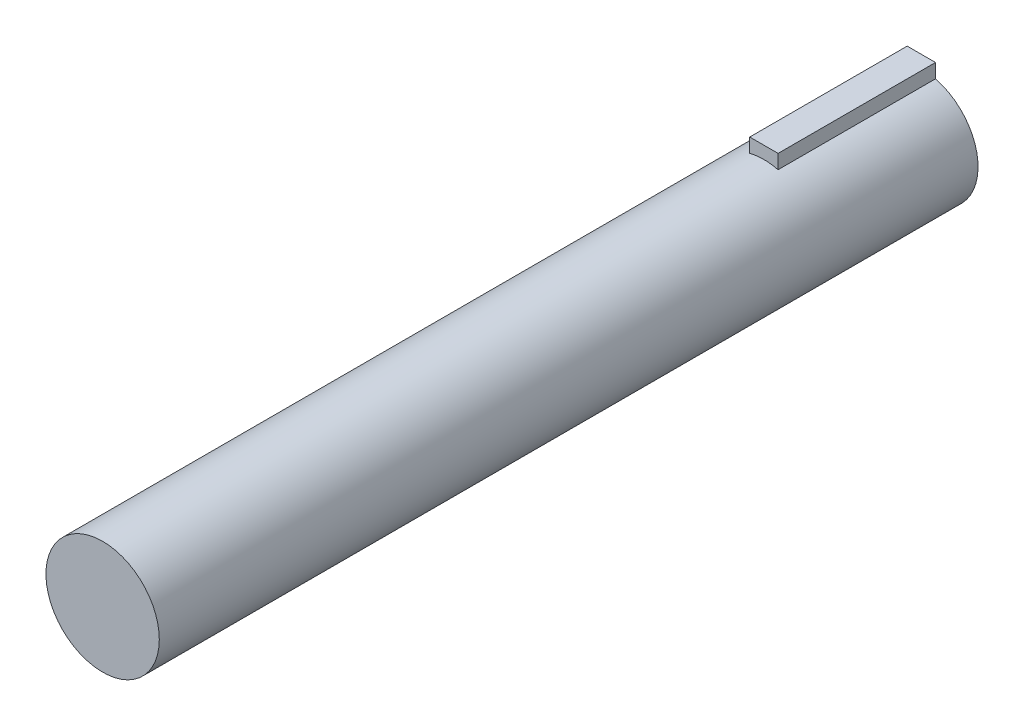
ISO-10303-21;
HEADER;
FILE_DESCRIPTION(('STEP AP214'),'2;1');
FILE_NAME('part.step','',(''),(''),'','','');
FILE_SCHEMA(('AUTOMOTIVE_DESIGN { 1 0 10303 214 1 1 1 1 }'));
ENDSEC;
DATA;
#1=APPLICATION_CONTEXT('core data for automotive mechanical design processes');
#2=APPLICATION_PROTOCOL_DEFINITION('international standard','automotive_design',2000,#1);
#3=PRODUCT_CONTEXT('',#1,'mechanical');
#4=PRODUCT('Part','Part','',(#3));
#5=PRODUCT_RELATED_PRODUCT_CATEGORY('part','',(#4));
#6=PRODUCT_DEFINITION_FORMATION('','',#4);
#7=PRODUCT_DEFINITION_CONTEXT('part definition',#1,'design');
#8=PRODUCT_DEFINITION('design','',#6,#7);
#9=PRODUCT_DEFINITION_SHAPE('','',#8);
#10=(LENGTH_UNIT() NAMED_UNIT(*) SI_UNIT(.MILLI.,.METRE.));
#11=(NAMED_UNIT(*) PLANE_ANGLE_UNIT() SI_UNIT($,.RADIAN.));
#12=(NAMED_UNIT(*) SI_UNIT($,.STERADIAN.) SOLID_ANGLE_UNIT());
#13=UNCERTAINTY_MEASURE_WITH_UNIT(LENGTH_MEASURE(1.E-05),#10,'distance_accuracy_value','');
#14=(GEOMETRIC_REPRESENTATION_CONTEXT(3) GLOBAL_UNCERTAINTY_ASSIGNED_CONTEXT((#13)) GLOBAL_UNIT_ASSIGNED_CONTEXT((#10,
#11,#12)) REPRESENTATION_CONTEXT('',''));
#15=CARTESIAN_POINT('',(0.,0.,0.));
#16=DIRECTION('',(0.,0.,1.));
#17=DIRECTION('',(1.,0.,0.));
#18=AXIS2_PLACEMENT_3D('',#15,#16,#17);
#19=CARTESIAN_POINT('',(0.,0.,66.04));
#20=DIRECTION('',(0.,0.,-1.));
#21=DIRECTION('',(-1.,0.,0.));
#22=AXIS2_PLACEMENT_3D('',#19,#20,#21);
#23=CYLINDRICAL_SURFACE('',#22,4.572);
#24=CARTESIAN_POINT('',(0.,0.,0.));
#25=DIRECTION('',(0.,0.,1.));
#26=DIRECTION('',(1.,0.,0.));
#27=AXIS2_PLACEMENT_3D('',#24,#25,#26);
#28=CIRCLE('',#27,4.572);
#29=CARTESIAN_POINT('',(-1.143,4.42681996471508,0.));
#30=VERTEX_POINT('',#29);
#31=CARTESIAN_POINT('',(1.143,4.42681996471508,0.));
#32=VERTEX_POINT('',#31);
#33=EDGE_CURVE('E104',#30,#32,#28,.T.);
#34=ORIENTED_EDGE('',*,*,#33,.T.);
#35=DIRECTION('',(0.,0.,-1.));
#36=VECTOR('',#35,1.);
#37=CARTESIAN_POINT('',(1.143,4.42681996471508,66.04));
#38=LINE('',#37,#36);
#39=CARTESIAN_POINT('',(1.143,4.42681996471508,12.7));
#40=VERTEX_POINT('',#39);
#41=EDGE_CURVE('E47',#32,#40,#38,.F.);
#42=ORIENTED_EDGE('',*,*,#41,.T.);
#43=CARTESIAN_POINT('',(0.,0.,12.7));
#44=DIRECTION('',(0.,0.,-1.));
#45=DIRECTION('',(-1.,0.,0.));
#46=AXIS2_PLACEMENT_3D('',#43,#44,#45);
#47=CIRCLE('',#46,4.572);
#48=CARTESIAN_POINT('',(-1.143,4.42681996471508,12.7));
#49=VERTEX_POINT('',#48);
#50=EDGE_CURVE('E11',#49,#40,#47,.T.);
#51=ORIENTED_EDGE('',*,*,#50,.F.);
#52=DIRECTION('',(0.,0.,-1.));
#53=VECTOR('',#52,1.);
#54=CARTESIAN_POINT('',(-1.143,4.42681996471508,66.04));
#55=LINE('',#54,#53);
#56=EDGE_CURVE('E76',#49,#30,#55,.T.);
#57=ORIENTED_EDGE('',*,*,#56,.T.);
#58=EDGE_LOOP('',(#34,#42,#51,#57));
#59=FACE_BOUND('',#58,.T.);
#60=CARTESIAN_POINT('',(0.,0.,66.04));
#61=DIRECTION('',(0.,0.,1.));
#62=DIRECTION('',(1.,0.,0.));
#63=AXIS2_PLACEMENT_3D('',#60,#61,#62);
#64=CIRCLE('',#63,4.572);
#65=CARTESIAN_POINT('',(4.572,0.,66.04));
#66=VERTEX_POINT('',#65);
#67=EDGE_CURVE('E40',#66,#66,#64,.T.);
#68=ORIENTED_EDGE('',*,*,#67,.F.);
#69=EDGE_LOOP('',(#68));
#70=FACE_BOUND('',#69,.T.);
#71=ADVANCED_FACE('F33',(#59,#70),#23,.T.);
#72=CARTESIAN_POINT('',(0.,0.,66.04));
#73=DIRECTION('',(0.,0.,1.));
#74=DIRECTION('',(1.,0.,0.));
#75=AXIS2_PLACEMENT_3D('',#72,#73,#74);
#76=PLANE('',#75);
#77=ORIENTED_EDGE('',*,*,#67,.T.);
#78=EDGE_LOOP('',(#77));
#79=FACE_BOUND('',#78,.T.);
#80=ADVANCED_FACE('F113',(#79),#76,.T.);
#81=CARTESIAN_POINT('',(0.,0.,0.));
#82=DIRECTION('',(0.,0.,1.));
#83=DIRECTION('',(1.,0.,0.));
#84=AXIS2_PLACEMENT_3D('',#81,#82,#83);
#85=PLANE('',#84);
#86=ORIENTED_EDGE('',*,*,#33,.F.);
#87=DIRECTION('',(0.,1.,0.));
#88=VECTOR('',#87,1.);
#89=CARTESIAN_POINT('',(-1.143,5.56981996471508,0.));
#90=LINE('',#89,#88);
#91=CARTESIAN_POINT('',(-1.143,5.56981996471508,0.));
#92=VERTEX_POINT('',#91);
#93=EDGE_CURVE('E98',#30,#92,#90,.T.);
#94=ORIENTED_EDGE('',*,*,#93,.T.);
#95=DIRECTION('',(1.,0.,0.));
#96=VECTOR('',#95,1.);
#97=CARTESIAN_POINT('',(1.143,5.56981996471508,0.));
#98=LINE('',#97,#96);
#99=CARTESIAN_POINT('',(1.143,5.56981996471508,0.));
#100=VERTEX_POINT('',#99);
#101=EDGE_CURVE('E86',#92,#100,#98,.T.);
#102=ORIENTED_EDGE('',*,*,#101,.T.);
#103=DIRECTION('',(0.,-1.,0.));
#104=VECTOR('',#103,1.);
#105=CARTESIAN_POINT('',(1.143,5.56981996471508,0.));
#106=LINE('',#105,#104);
#107=EDGE_CURVE('E95',#100,#32,#106,.T.);
#108=ORIENTED_EDGE('',*,*,#107,.T.);
#109=EDGE_LOOP('',(#86,#94,#102,#108));
#110=FACE_BOUND('',#109,.T.);
#111=ADVANCED_FACE('F111',(#110),#85,.F.);
#112=CARTESIAN_POINT('',(1.143,5.56981996471508,12.7));
#113=DIRECTION('',(1.,0.,0.));
#114=DIRECTION('',(0.,0.,-1.));
#115=AXIS2_PLACEMENT_3D('',#112,#113,#114);
#116=PLANE('',#115);
#117=ORIENTED_EDGE('',*,*,#41,.F.);
#118=ORIENTED_EDGE('',*,*,#107,.F.);
#119=DIRECTION('',(0.,0.,-1.));
#120=VECTOR('',#119,1.);
#121=CARTESIAN_POINT('',(1.143,5.56981996471508,12.7));
#122=LINE('',#121,#120);
#123=CARTESIAN_POINT('',(1.143,5.56981996471508,12.7));
#124=VERTEX_POINT('',#123);
#125=EDGE_CURVE('E87',#124,#100,#122,.T.);
#126=ORIENTED_EDGE('',*,*,#125,.F.);
#127=DIRECTION('',(0.,-1.,0.));
#128=VECTOR('',#127,1.);
#129=CARTESIAN_POINT('',(1.143,5.56981996471508,12.7));
#130=LINE('',#129,#128);
#131=EDGE_CURVE('E80',#124,#40,#130,.T.);
#132=ORIENTED_EDGE('',*,*,#131,.T.);
#133=EDGE_LOOP('',(#117,#118,#126,#132));
#134=FACE_BOUND('',#133,.T.);
#135=ADVANCED_FACE('F110',(#134),#116,.T.);
#136=CARTESIAN_POINT('',(-1.143,5.56981996471508,12.7));
#137=DIRECTION('',(-1.,0.,0.));
#138=DIRECTION('',(0.,-1.,0.));
#139=AXIS2_PLACEMENT_3D('',#136,#137,#138);
#140=PLANE('',#139);
#141=ORIENTED_EDGE('',*,*,#56,.F.);
#142=DIRECTION('',(0.,1.,0.));
#143=VECTOR('',#142,1.);
#144=CARTESIAN_POINT('',(-1.143,5.56981996471508,12.7));
#145=LINE('',#144,#143);
#146=CARTESIAN_POINT('',(-1.143,5.56981996471508,12.7));
#147=VERTEX_POINT('',#146);
#148=EDGE_CURVE('E70',#49,#147,#145,.T.);
#149=ORIENTED_EDGE('',*,*,#148,.T.);
#150=DIRECTION('',(0.,0.,-1.));
#151=VECTOR('',#150,1.);
#152=CARTESIAN_POINT('',(-1.143,5.56981996471508,12.7));
#153=LINE('',#152,#151);
#154=EDGE_CURVE('E74',#147,#92,#153,.T.);
#155=ORIENTED_EDGE('',*,*,#154,.T.);
#156=ORIENTED_EDGE('',*,*,#93,.F.);
#157=EDGE_LOOP('',(#141,#149,#155,#156));
#158=FACE_BOUND('',#157,.T.);
#159=ADVANCED_FACE('F72',(#158),#140,.T.);
#160=CARTESIAN_POINT('',(1.143,5.56981996471508,12.7));
#161=DIRECTION('',(0.,1.,0.));
#162=DIRECTION('',(0.,0.,1.));
#163=AXIS2_PLACEMENT_3D('',#160,#161,#162);
#164=PLANE('',#163);
#165=ORIENTED_EDGE('',*,*,#101,.F.);
#166=ORIENTED_EDGE('',*,*,#154,.F.);
#167=DIRECTION('',(1.,0.,0.));
#168=VECTOR('',#167,1.);
#169=CARTESIAN_POINT('',(1.143,5.56981996471508,12.7));
#170=LINE('',#169,#168);
#171=EDGE_CURVE('E79',#147,#124,#170,.T.);
#172=ORIENTED_EDGE('',*,*,#171,.T.);
#173=ORIENTED_EDGE('',*,*,#125,.T.);
#174=EDGE_LOOP('',(#165,#166,#172,#173));
#175=FACE_BOUND('',#174,.T.);
#176=ADVANCED_FACE('F84',(#175),#164,.T.);
#177=CARTESIAN_POINT('',(0.,0.,12.7));
#178=DIRECTION('',(0.,0.,-1.));
#179=DIRECTION('',(-1.,0.,0.));
#180=AXIS2_PLACEMENT_3D('',#177,#178,#179);
#181=PLANE('',#180);
#182=ORIENTED_EDGE('',*,*,#148,.F.);
#183=ORIENTED_EDGE('',*,*,#50,.T.);
#184=ORIENTED_EDGE('',*,*,#131,.F.);
#185=ORIENTED_EDGE('',*,*,#171,.F.);
#186=EDGE_LOOP('',(#182,#183,#184,#185));
#187=FACE_BOUND('',#186,.T.);
#188=ADVANCED_FACE('F90',(#187),#181,.F.);
#189=CLOSED_SHELL('',(#71,#80,#111,#135,#159,#176,#188));
#190=MANIFOLD_SOLID_BREP('B2',#189);
#191=ADVANCED_BREP_SHAPE_REPRESENTATION('',(#18,#190),#14);
#192=SHAPE_DEFINITION_REPRESENTATION(#9,#191);
ENDSEC;
END-ISO-10303-21;
